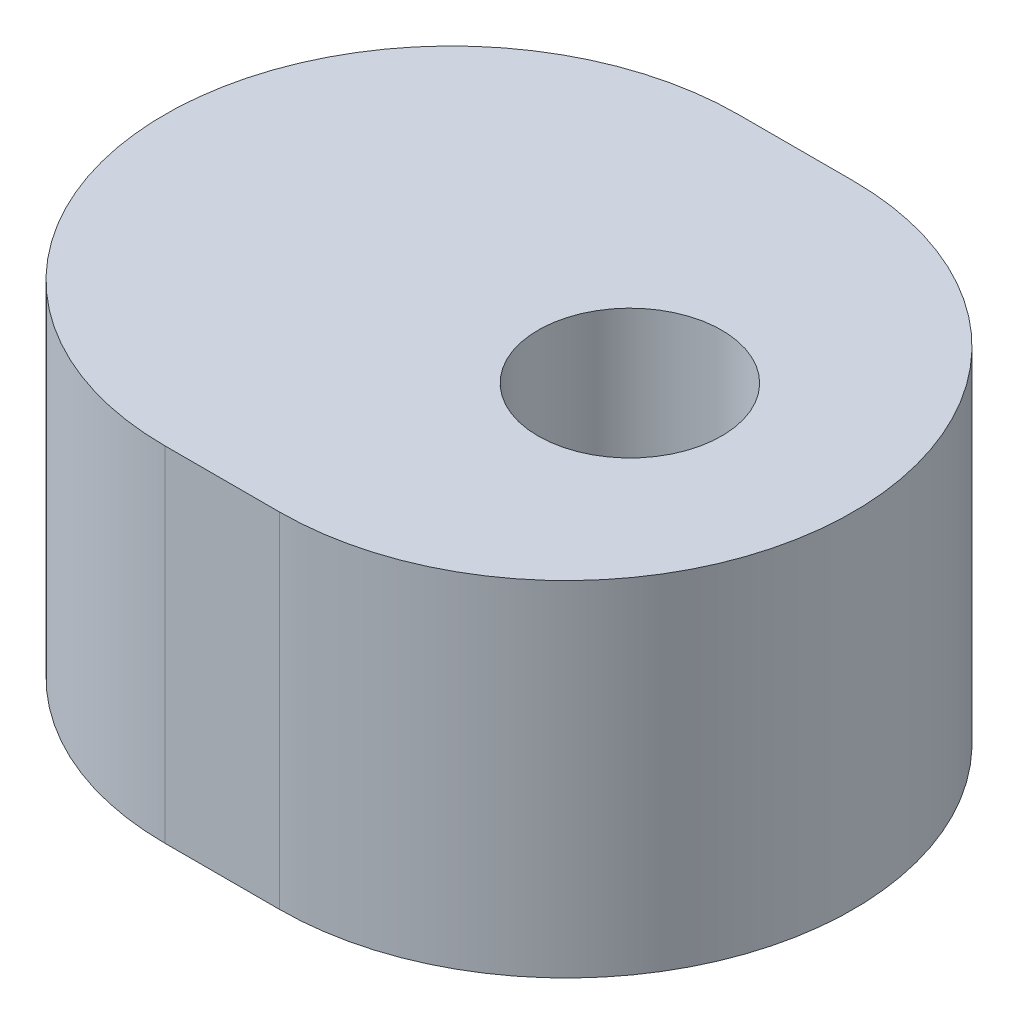
ISO-10303-21;
HEADER;
FILE_DESCRIPTION(('STEP AP214'),'2;1');
FILE_NAME('part.step','',(''),(''),'','','');
FILE_SCHEMA(('AUTOMOTIVE_DESIGN { 1 0 10303 214 1 1 1 1 }'));
ENDSEC;
DATA;
#1=APPLICATION_CONTEXT('core data for automotive mechanical design processes');
#2=APPLICATION_PROTOCOL_DEFINITION('international standard','automotive_design',2000,#1);
#3=PRODUCT_CONTEXT('',#1,'mechanical');
#4=PRODUCT('Part','Part','',(#3));
#5=PRODUCT_RELATED_PRODUCT_CATEGORY('part','',(#4));
#6=PRODUCT_DEFINITION_FORMATION('','',#4);
#7=PRODUCT_DEFINITION_CONTEXT('part definition',#1,'design');
#8=PRODUCT_DEFINITION('design','',#6,#7);
#9=PRODUCT_DEFINITION_SHAPE('','',#8);
#10=(LENGTH_UNIT() NAMED_UNIT(*) SI_UNIT(.MILLI.,.METRE.));
#11=(NAMED_UNIT(*) PLANE_ANGLE_UNIT() SI_UNIT($,.RADIAN.));
#12=(NAMED_UNIT(*) SI_UNIT($,.STERADIAN.) SOLID_ANGLE_UNIT());
#13=UNCERTAINTY_MEASURE_WITH_UNIT(LENGTH_MEASURE(1.E-05),#10,'distance_accuracy_value','');
#14=(GEOMETRIC_REPRESENTATION_CONTEXT(3) GLOBAL_UNCERTAINTY_ASSIGNED_CONTEXT((#13)) GLOBAL_UNIT_ASSIGNED_CONTEXT((#10,
#11,#12)) REPRESENTATION_CONTEXT('',''));
#15=CARTESIAN_POINT('',(0.,0.,0.));
#16=DIRECTION('',(0.,0.,1.));
#17=DIRECTION('',(1.,0.,0.));
#18=AXIS2_PLACEMENT_3D('',#15,#16,#17);
#19=CARTESIAN_POINT('',(-3.10734814592699,-12.,0.));
#20=DIRECTION('',(0.,-1.,0.));
#21=DIRECTION('',(0.,0.,-1.));
#22=AXIS2_PLACEMENT_3D('',#19,#20,#21);
#23=CYLINDRICAL_SURFACE('',#22,4.99999999999998);
#24=CARTESIAN_POINT('',(-3.10734814592699,-18.,0.));
#25=DIRECTION('',(0.,-1.,0.));
#26=DIRECTION('',(0.,0.,-1.));
#27=AXIS2_PLACEMENT_3D('',#24,#25,#26);
#28=CIRCLE('',#27,4.99999999999998);
#29=CARTESIAN_POINT('',(-3.10734814592699,-18.,4.99999999999998));
#30=VERTEX_POINT('',#29);
#31=CARTESIAN_POINT('',(-3.10734814592699,-18.,-4.99999999999998));
#32=VERTEX_POINT('',#31);
#33=EDGE_CURVE('E97',#30,#32,#28,.T.);
#34=ORIENTED_EDGE('',*,*,#33,.F.);
#35=DIRECTION('',(0.,-1.,0.));
#36=VECTOR('',#35,1.);
#37=CARTESIAN_POINT('',(-3.10734814592699,-12.,4.99999999999998));
#38=LINE('',#37,#36);
#39=CARTESIAN_POINT('',(-3.10734814592699,-12.,4.99999999999998));
#40=VERTEX_POINT('',#39);
#41=EDGE_CURVE('E11',#40,#30,#38,.T.);
#42=ORIENTED_EDGE('',*,*,#41,.F.);
#43=CARTESIAN_POINT('',(-3.10734814592699,-12.,0.));
#44=DIRECTION('',(0.,-1.,0.));
#45=DIRECTION('',(0.,0.,-1.));
#46=AXIS2_PLACEMENT_3D('',#43,#44,#45);
#47=CIRCLE('',#46,4.99999999999998);
#48=CARTESIAN_POINT('',(-3.10734814592699,-12.,-4.99999999999998));
#49=VERTEX_POINT('',#48);
#50=EDGE_CURVE('E90',#40,#49,#47,.T.);
#51=ORIENTED_EDGE('',*,*,#50,.T.);
#52=DIRECTION('',(0.,-1.,0.));
#53=VECTOR('',#52,1.);
#54=CARTESIAN_POINT('',(-3.10734814592699,-12.,-4.99999999999998));
#55=LINE('',#54,#53);
#56=EDGE_CURVE('E35',#49,#32,#55,.T.);
#57=ORIENTED_EDGE('',*,*,#56,.T.);
#58=EDGE_LOOP('',(#34,#42,#51,#57));
#59=FACE_BOUND('',#58,.T.);
#60=ADVANCED_FACE('F32',(#59),#23,.T.);
#61=CARTESIAN_POINT('',(-1.1073481459269,-12.,4.99999999999998));
#62=DIRECTION('',(0.,0.,1.));
#63=DIRECTION('',(1.,0.,0.));
#64=AXIS2_PLACEMENT_3D('',#61,#62,#63);
#65=PLANE('',#64);
#66=DIRECTION('',(-1.,0.,0.));
#67=VECTOR('',#66,1.);
#68=CARTESIAN_POINT('',(-1.1073481459269,-18.,4.99999999999998));
#69=LINE('',#68,#67);
#70=CARTESIAN_POINT('',(-1.1073481459269,-18.,4.99999999999998));
#71=VERTEX_POINT('',#70);
#72=EDGE_CURVE('E92',#71,#30,#69,.T.);
#73=ORIENTED_EDGE('',*,*,#72,.F.);
#74=DIRECTION('',(0.,-1.,0.));
#75=VECTOR('',#74,1.);
#76=CARTESIAN_POINT('',(-1.1073481459269,-12.,4.99999999999998));
#77=LINE('',#76,#75);
#78=CARTESIAN_POINT('',(-1.1073481459269,-12.,4.99999999999998));
#79=VERTEX_POINT('',#78);
#80=EDGE_CURVE('E41',#79,#71,#77,.T.);
#81=ORIENTED_EDGE('',*,*,#80,.F.);
#82=DIRECTION('',(-1.,0.,0.));
#83=VECTOR('',#82,1.);
#84=CARTESIAN_POINT('',(-1.1073481459269,-12.,4.99999999999998));
#85=LINE('',#84,#83);
#86=EDGE_CURVE('E87',#79,#40,#85,.T.);
#87=ORIENTED_EDGE('',*,*,#86,.T.);
#88=ORIENTED_EDGE('',*,*,#41,.T.);
#89=EDGE_LOOP('',(#73,#81,#87,#88));
#90=FACE_BOUND('',#89,.T.);
#91=ADVANCED_FACE('F108',(#90),#65,.T.);
#92=CARTESIAN_POINT('',(-1.1073481459269,-12.,0.));
#93=DIRECTION('',(0.,-1.,0.));
#94=DIRECTION('',(0.,0.,-1.));
#95=AXIS2_PLACEMENT_3D('',#92,#93,#94);
#96=CYLINDRICAL_SURFACE('',#95,4.99999999999998);
#97=CARTESIAN_POINT('',(-1.1073481459269,-18.,0.));
#98=DIRECTION('',(0.,-1.,0.));
#99=DIRECTION('',(0.,0.,-1.));
#100=AXIS2_PLACEMENT_3D('',#97,#98,#99);
#101=CIRCLE('',#100,4.99999999999998);
#102=CARTESIAN_POINT('',(-1.1073481459269,-18.,-4.99999999999998));
#103=VERTEX_POINT('',#102);
#104=EDGE_CURVE('E82',#103,#71,#101,.T.);
#105=ORIENTED_EDGE('',*,*,#104,.F.);
#106=DIRECTION('',(0.,-1.,0.));
#107=VECTOR('',#106,1.);
#108=CARTESIAN_POINT('',(-1.1073481459269,-12.,-4.99999999999998));
#109=LINE('',#108,#107);
#110=CARTESIAN_POINT('',(-1.1073481459269,-12.,-4.99999999999998));
#111=VERTEX_POINT('',#110);
#112=EDGE_CURVE('E77',#111,#103,#109,.T.);
#113=ORIENTED_EDGE('',*,*,#112,.F.);
#114=CARTESIAN_POINT('',(-1.1073481459269,-12.,0.));
#115=DIRECTION('',(0.,-1.,0.));
#116=DIRECTION('',(0.,0.,-1.));
#117=AXIS2_PLACEMENT_3D('',#114,#115,#116);
#118=CIRCLE('',#117,4.99999999999998);
#119=EDGE_CURVE('E80',#111,#79,#118,.T.);
#120=ORIENTED_EDGE('',*,*,#119,.T.);
#121=ORIENTED_EDGE('',*,*,#80,.T.);
#122=EDGE_LOOP('',(#105,#113,#120,#121));
#123=FACE_BOUND('',#122,.T.);
#124=ADVANCED_FACE('F79',(#123),#96,.T.);
#125=CARTESIAN_POINT('',(-3.10734814592699,-12.,-4.99999999999998));
#126=DIRECTION('',(0.,0.,-1.));
#127=DIRECTION('',(-1.,0.,0.));
#128=AXIS2_PLACEMENT_3D('',#125,#126,#127);
#129=PLANE('',#128);
#130=DIRECTION('',(1.,0.,0.));
#131=VECTOR('',#130,1.);
#132=CARTESIAN_POINT('',(-3.10734814592699,-18.,-4.99999999999998));
#133=LINE('',#132,#131);
#134=EDGE_CURVE('E100',#32,#103,#133,.T.);
#135=ORIENTED_EDGE('',*,*,#134,.F.);
#136=ORIENTED_EDGE('',*,*,#56,.F.);
#137=DIRECTION('',(1.,0.,0.));
#138=VECTOR('',#137,1.);
#139=CARTESIAN_POINT('',(-3.10734814592699,-12.,-4.99999999999998));
#140=LINE('',#139,#138);
#141=EDGE_CURVE('E86',#49,#111,#140,.T.);
#142=ORIENTED_EDGE('',*,*,#141,.T.);
#143=ORIENTED_EDGE('',*,*,#112,.T.);
#144=EDGE_LOOP('',(#135,#136,#142,#143));
#145=FACE_BOUND('',#144,.T.);
#146=ADVANCED_FACE('F89',(#145),#129,.T.);
#147=CARTESIAN_POINT('',(-3.10734814592699,-12.,0.));
#148=DIRECTION('',(0.,-1.,0.));
#149=DIRECTION('',(0.,0.,-1.));
#150=AXIS2_PLACEMENT_3D('',#147,#148,#149);
#151=PLANE('',#150);
#152=CARTESIAN_POINT('',(0.,-12.,0.));
#153=DIRECTION('',(0.,-1.,0.));
#154=DIRECTION('',(0.,0.,1.));
#155=AXIS2_PLACEMENT_3D('',#152,#153,#154);
#156=CIRCLE('',#155,1.6);
#157=CARTESIAN_POINT('',(0.,-12.,1.6));
#158=VERTEX_POINT('',#157);
#159=EDGE_CURVE('E101',#158,#158,#156,.T.);
#160=ORIENTED_EDGE('',*,*,#159,.T.);
#161=EDGE_LOOP('',(#160));
#162=FACE_BOUND('',#161,.T.);
#163=ORIENTED_EDGE('',*,*,#50,.F.);
#164=ORIENTED_EDGE('',*,*,#86,.F.);
#165=ORIENTED_EDGE('',*,*,#119,.F.);
#166=ORIENTED_EDGE('',*,*,#141,.F.);
#167=EDGE_LOOP('',(#163,#164,#165,#166));
#168=FACE_BOUND('',#167,.T.);
#169=ADVANCED_FACE('F85',(#162,#168),#151,.F.);
#170=CARTESIAN_POINT('',(-3.10734814592699,-18.,0.));
#171=DIRECTION('',(0.,-1.,0.));
#172=DIRECTION('',(0.,0.,-1.));
#173=AXIS2_PLACEMENT_3D('',#170,#171,#172);
#174=PLANE('',#173);
#175=CARTESIAN_POINT('',(0.,-18.,0.));
#176=DIRECTION('',(0.,-1.,0.));
#177=DIRECTION('',(0.,0.,1.));
#178=AXIS2_PLACEMENT_3D('',#175,#176,#177);
#179=CIRCLE('',#178,1.6);
#180=CARTESIAN_POINT('',(0.,-18.,1.6));
#181=VERTEX_POINT('',#180);
#182=EDGE_CURVE('E138',#181,#181,#179,.T.);
#183=ORIENTED_EDGE('',*,*,#182,.F.);
#184=EDGE_LOOP('',(#183));
#185=FACE_BOUND('',#184,.T.);
#186=ORIENTED_EDGE('',*,*,#33,.T.);
#187=ORIENTED_EDGE('',*,*,#134,.T.);
#188=ORIENTED_EDGE('',*,*,#104,.T.);
#189=ORIENTED_EDGE('',*,*,#72,.T.);
#190=EDGE_LOOP('',(#186,#187,#188,#189));
#191=FACE_BOUND('',#190,.T.);
#192=ADVANCED_FACE('F107',(#185,#191),#174,.T.);
#193=CARTESIAN_POINT('',(0.,-12.,0.));
#194=DIRECTION('',(0.,-1.,0.));
#195=DIRECTION('',(0.,0.,-1.));
#196=AXIS2_PLACEMENT_3D('',#193,#194,#195);
#197=CYLINDRICAL_SURFACE('',#196,1.6);
#198=ORIENTED_EDGE('',*,*,#159,.F.);
#199=EDGE_LOOP('',(#198));
#200=FACE_BOUND('',#199,.T.);
#201=ORIENTED_EDGE('',*,*,#182,.T.);
#202=EDGE_LOOP('',(#201));
#203=FACE_BOUND('',#202,.T.);
#204=ADVANCED_FACE('F126',(#200,#203),#197,.F.);
#205=CLOSED_SHELL('',(#60,#91,#124,#146,#169,#192,#204));
#206=MANIFOLD_SOLID_BREP('B2',#205);
#207=ADVANCED_BREP_SHAPE_REPRESENTATION('',(#18,#206),#14);
#208=SHAPE_DEFINITION_REPRESENTATION(#9,#207);
ENDSEC;
END-ISO-10303-21;
